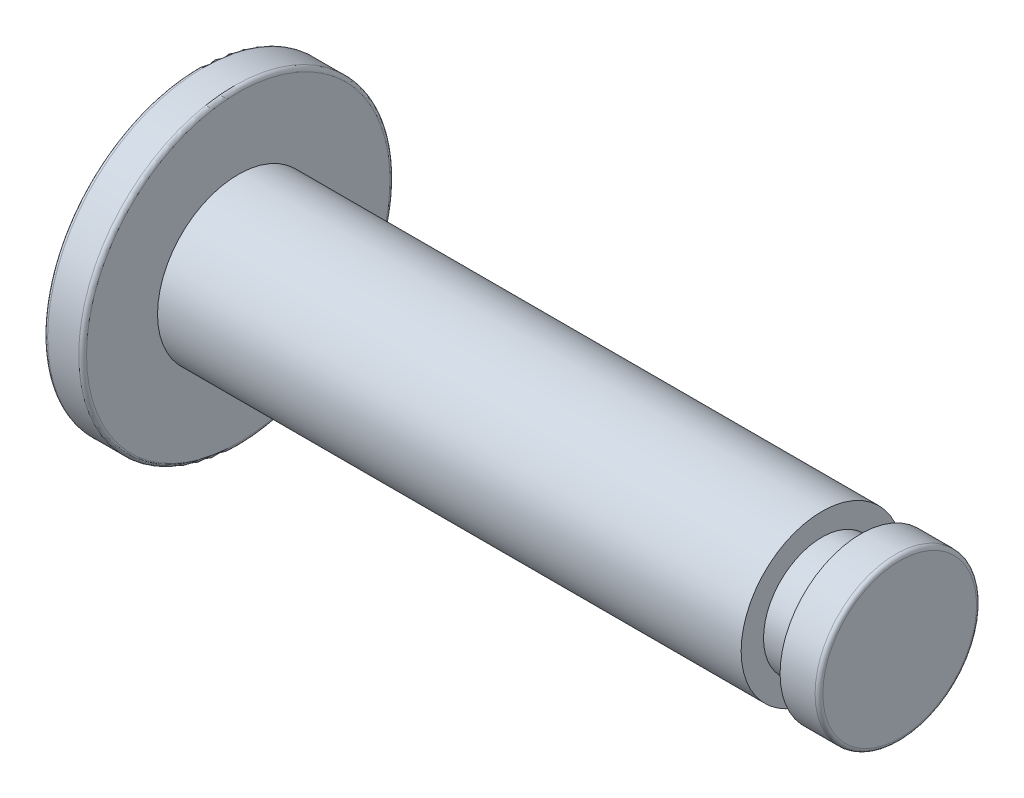
ISO-10303-21;
HEADER;
FILE_DESCRIPTION(('STEP AP214'),'2;1');
FILE_NAME('part.step','',(''),(''),'','','');
FILE_SCHEMA(('AUTOMOTIVE_DESIGN { 1 0 10303 214 1 1 1 1 }'));
ENDSEC;
DATA;
#1=APPLICATION_CONTEXT('core data for automotive mechanical design processes');
#2=APPLICATION_PROTOCOL_DEFINITION('international standard','automotive_design',2000,#1);
#3=PRODUCT_CONTEXT('',#1,'mechanical');
#4=PRODUCT('Part','Part','',(#3));
#5=PRODUCT_RELATED_PRODUCT_CATEGORY('part','',(#4));
#6=PRODUCT_DEFINITION_FORMATION('','',#4);
#7=PRODUCT_DEFINITION_CONTEXT('part definition',#1,'design');
#8=PRODUCT_DEFINITION('design','',#6,#7);
#9=PRODUCT_DEFINITION_SHAPE('','',#8);
#10=(LENGTH_UNIT() NAMED_UNIT(*) SI_UNIT(.MILLI.,.METRE.));
#11=(NAMED_UNIT(*) PLANE_ANGLE_UNIT() SI_UNIT($,.RADIAN.));
#12=(NAMED_UNIT(*) SI_UNIT($,.STERADIAN.) SOLID_ANGLE_UNIT());
#13=UNCERTAINTY_MEASURE_WITH_UNIT(LENGTH_MEASURE(1.E-05),#10,'distance_accuracy_value','');
#14=(GEOMETRIC_REPRESENTATION_CONTEXT(3) GLOBAL_UNCERTAINTY_ASSIGNED_CONTEXT((#13)) GLOBAL_UNIT_ASSIGNED_CONTEXT((#10,
#11,#12)) REPRESENTATION_CONTEXT('',''));
#15=CARTESIAN_POINT('',(0.,0.,0.));
#16=DIRECTION('',(0.,0.,1.));
#17=DIRECTION('',(1.,0.,0.));
#18=AXIS2_PLACEMENT_3D('',#15,#16,#17);
#19=CARTESIAN_POINT('',(0.,0.,0.));
#20=DIRECTION('',(1.,0.,0.));
#21=DIRECTION('',(0.,0.,-1.));
#22=AXIS2_PLACEMENT_3D('',#19,#20,#21);
#23=PLANE('',#22);
#24=CARTESIAN_POINT('',(0.,0.,0.));
#25=DIRECTION('',(1.,0.,0.));
#26=DIRECTION('',(0.,0.,-1.));
#27=AXIS2_PLACEMENT_3D('',#24,#25,#26);
#28=CIRCLE('',#27,3.9);
#29=CARTESIAN_POINT('',(0.,0.,-3.9));
#30=VERTEX_POINT('',#29);
#31=EDGE_CURVE('E43',#30,#30,#28,.F.);
#32=ORIENTED_EDGE('',*,*,#31,.T.);
#33=EDGE_LOOP('',(#32));
#34=FACE_BOUND('',#33,.T.);
#35=ADVANCED_FACE('F28',(#34),#23,.F.);
#36=CARTESIAN_POINT('',(-1.61966058348987,0.,0.));
#37=DIRECTION('',(-1.,0.,0.));
#38=DIRECTION('',(0.,0.,1.));
#39=AXIS2_PLACEMENT_3D('',#36,#37,#38);
#40=CYLINDRICAL_SURFACE('',#39,4.);
#41=CARTESIAN_POINT('',(0.1,0.,0.));
#42=DIRECTION('',(1.,0.,0.));
#43=DIRECTION('',(0.,0.,-1.));
#44=AXIS2_PLACEMENT_3D('',#41,#42,#43);
#45=CIRCLE('',#44,4.);
#46=CARTESIAN_POINT('',(0.1,0.,-4.));
#47=VERTEX_POINT('',#46);
#48=EDGE_CURVE('E35',#47,#47,#45,.T.);
#49=ORIENTED_EDGE('',*,*,#48,.T.);
#50=EDGE_LOOP('',(#49));
#51=FACE_BOUND('',#50,.T.);
#52=CARTESIAN_POINT('',(0.9,0.,0.));
#53=DIRECTION('',(-1.,0.,0.));
#54=DIRECTION('',(0.,0.,1.));
#55=AXIS2_PLACEMENT_3D('',#52,#53,#54);
#56=CIRCLE('',#55,4.);
#57=CARTESIAN_POINT('',(0.9,0.,4.));
#58=VERTEX_POINT('',#57);
#59=EDGE_CURVE('E39',#58,#58,#56,.T.);
#60=ORIENTED_EDGE('',*,*,#59,.T.);
#61=EDGE_LOOP('',(#60));
#62=FACE_BOUND('',#61,.T.);
#63=ADVANCED_FACE('F88',(#51,#62),#40,.T.);
#64=CARTESIAN_POINT('',(1.,4.,0.));
#65=DIRECTION('',(-1.,0.,0.));
#66=DIRECTION('',(0.,0.,1.));
#67=AXIS2_PLACEMENT_3D('',#64,#65,#66);
#68=PLANE('',#67);
#69=CARTESIAN_POINT('',(1.,0.,0.));
#70=DIRECTION('',(-1.,0.,0.));
#71=DIRECTION('',(0.,0.,1.));
#72=AXIS2_PLACEMENT_3D('',#69,#70,#71);
#73=CIRCLE('',#72,3.9);
#74=CARTESIAN_POINT('',(1.,0.,3.9));
#75=VERTEX_POINT('',#74);
#76=EDGE_CURVE('E10',#75,#75,#73,.F.);
#77=ORIENTED_EDGE('',*,*,#76,.T.);
#78=EDGE_LOOP('',(#77));
#79=FACE_BOUND('',#78,.T.);
#80=CARTESIAN_POINT('',(1.,0.,0.));
#81=DIRECTION('',(-1.,0.,0.));
#82=DIRECTION('',(0.,0.,1.));
#83=AXIS2_PLACEMENT_3D('',#80,#81,#82);
#84=CIRCLE('',#83,2.075);
#85=CARTESIAN_POINT('',(1.,0.,2.075));
#86=VERTEX_POINT('',#85);
#87=EDGE_CURVE('E54',#86,#86,#84,.T.);
#88=ORIENTED_EDGE('',*,*,#87,.T.);
#89=EDGE_LOOP('',(#88));
#90=FACE_BOUND('',#89,.T.);
#91=ADVANCED_FACE('F94',(#79,#90),#68,.F.);
#92=CARTESIAN_POINT('',(-1.61966058348987,0.,0.));
#93=DIRECTION('',(-1.,0.,0.));
#94=DIRECTION('',(0.,0.,1.));
#95=AXIS2_PLACEMENT_3D('',#92,#93,#94);
#96=CYLINDRICAL_SURFACE('',#95,2.075);
#97=ORIENTED_EDGE('',*,*,#87,.F.);
#98=EDGE_LOOP('',(#97));
#99=FACE_BOUND('',#98,.T.);
#100=CARTESIAN_POINT('',(16.,0.,0.));
#101=DIRECTION('',(-1.,0.,0.));
#102=DIRECTION('',(0.,0.,1.));
#103=AXIS2_PLACEMENT_3D('',#100,#101,#102);
#104=CIRCLE('',#103,2.075);
#105=CARTESIAN_POINT('',(16.,0.,2.075));
#106=VERTEX_POINT('',#105);
#107=EDGE_CURVE('E57',#106,#106,#104,.T.);
#108=ORIENTED_EDGE('',*,*,#107,.T.);
#109=EDGE_LOOP('',(#108));
#110=FACE_BOUND('',#109,.T.);
#111=ADVANCED_FACE('F144',(#99,#110),#96,.T.);
#112=CARTESIAN_POINT('',(16.,2.075,0.));
#113=DIRECTION('',(-1.,0.,0.));
#114=DIRECTION('',(0.,0.,1.));
#115=AXIS2_PLACEMENT_3D('',#112,#113,#114);
#116=PLANE('',#115);
#117=ORIENTED_EDGE('',*,*,#107,.F.);
#118=EDGE_LOOP('',(#117));
#119=FACE_BOUND('',#118,.T.);
#120=CARTESIAN_POINT('',(16.,0.,0.));
#121=DIRECTION('',(-1.,0.,0.));
#122=DIRECTION('',(0.,0.,1.));
#123=AXIS2_PLACEMENT_3D('',#120,#121,#122);
#124=CIRCLE('',#123,1.5);
#125=CARTESIAN_POINT('',(16.,0.,1.5));
#126=VERTEX_POINT('',#125);
#127=EDGE_CURVE('E60',#126,#126,#124,.T.);
#128=ORIENTED_EDGE('',*,*,#127,.T.);
#129=EDGE_LOOP('',(#128));
#130=FACE_BOUND('',#129,.T.);
#131=ADVANCED_FACE('F169',(#119,#130),#116,.F.);
#132=CARTESIAN_POINT('',(-1.61966058348987,0.,0.));
#133=DIRECTION('',(-1.,0.,0.));
#134=DIRECTION('',(0.,0.,1.));
#135=AXIS2_PLACEMENT_3D('',#132,#133,#134);
#136=CYLINDRICAL_SURFACE('',#135,1.5);
#137=ORIENTED_EDGE('',*,*,#127,.F.);
#138=EDGE_LOOP('',(#137));
#139=FACE_BOUND('',#138,.T.);
#140=CARTESIAN_POINT('',(17.,0.,0.));
#141=DIRECTION('',(-1.,0.,0.));
#142=DIRECTION('',(0.,0.,1.));
#143=AXIS2_PLACEMENT_3D('',#140,#141,#142);
#144=CIRCLE('',#143,1.5);
#145=CARTESIAN_POINT('',(17.,0.,1.5));
#146=VERTEX_POINT('',#145);
#147=EDGE_CURVE('E63',#146,#146,#144,.T.);
#148=ORIENTED_EDGE('',*,*,#147,.T.);
#149=EDGE_LOOP('',(#148));
#150=FACE_BOUND('',#149,.T.);
#151=ADVANCED_FACE('F84',(#139,#150),#136,.T.);
#152=CARTESIAN_POINT('',(17.,1.5,0.));
#153=DIRECTION('',(1.,0.,0.));
#154=DIRECTION('',(0.,0.,-1.));
#155=AXIS2_PLACEMENT_3D('',#152,#153,#154);
#156=PLANE('',#155);
#157=ORIENTED_EDGE('',*,*,#147,.F.);
#158=EDGE_LOOP('',(#157));
#159=FACE_BOUND('',#158,.T.);
#160=CARTESIAN_POINT('',(17.,0.,0.));
#161=DIRECTION('',(-1.,0.,0.));
#162=DIRECTION('',(0.,0.,1.));
#163=AXIS2_PLACEMENT_3D('',#160,#161,#162);
#164=CIRCLE('',#163,2.075);
#165=CARTESIAN_POINT('',(17.,0.,2.075));
#166=VERTEX_POINT('',#165);
#167=EDGE_CURVE('E66',#166,#166,#164,.T.);
#168=ORIENTED_EDGE('',*,*,#167,.T.);
#169=EDGE_LOOP('',(#168));
#170=FACE_BOUND('',#169,.T.);
#171=ADVANCED_FACE('F70',(#159,#170),#156,.F.);
#172=CARTESIAN_POINT('',(-1.61966058348987,0.,0.));
#173=DIRECTION('',(-1.,0.,0.));
#174=DIRECTION('',(0.,0.,1.));
#175=AXIS2_PLACEMENT_3D('',#172,#173,#174);
#176=CYLINDRICAL_SURFACE('',#175,2.075);
#177=CARTESIAN_POINT('',(17.9,0.,0.));
#178=DIRECTION('',(-1.,0.,0.));
#179=DIRECTION('',(0.,0.,1.));
#180=AXIS2_PLACEMENT_3D('',#177,#178,#179);
#181=CIRCLE('',#180,2.075);
#182=CARTESIAN_POINT('',(17.9,0.,2.075));
#183=VERTEX_POINT('',#182);
#184=EDGE_CURVE('E51',#183,#183,#181,.T.);
#185=ORIENTED_EDGE('',*,*,#184,.T.);
#186=EDGE_LOOP('',(#185));
#187=FACE_BOUND('',#186,.T.);
#188=ORIENTED_EDGE('',*,*,#167,.F.);
#189=EDGE_LOOP('',(#188));
#190=FACE_BOUND('',#189,.T.);
#191=ADVANCED_FACE('F72',(#187,#190),#176,.T.);
#192=CARTESIAN_POINT('',(18.,2.075,0.));
#193=DIRECTION('',(-1.,0.,0.));
#194=DIRECTION('',(0.,0.,1.));
#195=AXIS2_PLACEMENT_3D('',#192,#193,#194);
#196=PLANE('',#195);
#197=CARTESIAN_POINT('',(18.,0.,0.));
#198=DIRECTION('',(-1.,0.,0.));
#199=DIRECTION('',(0.,0.,1.));
#200=AXIS2_PLACEMENT_3D('',#197,#198,#199);
#201=CIRCLE('',#200,1.975);
#202=CARTESIAN_POINT('',(18.,0.,1.975));
#203=VERTEX_POINT('',#202);
#204=EDGE_CURVE('E48',#203,#203,#201,.F.);
#205=ORIENTED_EDGE('',*,*,#204,.T.);
#206=EDGE_LOOP('',(#205));
#207=FACE_BOUND('',#206,.T.);
#208=ADVANCED_FACE('F74',(#207),#196,.F.);
#209=CARTESIAN_POINT('',(17.9,0.,0.));
#210=DIRECTION('',(-1.,0.,0.));
#211=DIRECTION('',(0.,0.,1.));
#212=AXIS2_PLACEMENT_3D('',#209,#210,#211);
#213=TOROIDAL_SURFACE('',#212,1.975,0.1);
#214=ORIENTED_EDGE('',*,*,#204,.F.);
#215=EDGE_LOOP('',(#214));
#216=FACE_BOUND('',#215,.T.);
#217=ORIENTED_EDGE('',*,*,#184,.F.);
#218=EDGE_LOOP('',(#217));
#219=FACE_BOUND('',#218,.T.);
#220=ADVANCED_FACE('F81',(#216,#219),#213,.T.);
#221=CARTESIAN_POINT('',(0.1,0.,0.));
#222=DIRECTION('',(1.,0.,0.));
#223=DIRECTION('',(0.,0.,-1.));
#224=AXIS2_PLACEMENT_3D('',#221,#222,#223);
#225=TOROIDAL_SURFACE('',#224,3.9,0.1);
#226=ORIENTED_EDGE('',*,*,#48,.F.);
#227=EDGE_LOOP('',(#226));
#228=FACE_BOUND('',#227,.T.);
#229=ORIENTED_EDGE('',*,*,#31,.F.);
#230=EDGE_LOOP('',(#229));
#231=FACE_BOUND('',#230,.T.);
#232=ADVANCED_FACE('F99',(#228,#231),#225,.T.);
#233=CARTESIAN_POINT('',(0.9,0.,0.));
#234=DIRECTION('',(-1.,0.,0.));
#235=DIRECTION('',(0.,0.,1.));
#236=AXIS2_PLACEMENT_3D('',#233,#234,#235);
#237=TOROIDAL_SURFACE('',#236,3.9,0.1);
#238=ORIENTED_EDGE('',*,*,#76,.F.);
#239=EDGE_LOOP('',(#238));
#240=FACE_BOUND('',#239,.T.);
#241=ORIENTED_EDGE('',*,*,#59,.F.);
#242=EDGE_LOOP('',(#241));
#243=FACE_BOUND('',#242,.T.);
#244=ADVANCED_FACE('F30',(#240,#243),#237,.T.);
#245=CLOSED_SHELL('',(#35,#63,#91,#111,#131,#151,#171,#191,#208,#220,#232,#244));
#246=MANIFOLD_SOLID_BREP('B2',#245);
#247=ADVANCED_BREP_SHAPE_REPRESENTATION('',(#18,#246),#14);
#248=SHAPE_DEFINITION_REPRESENTATION(#9,#247);
ENDSEC;
END-ISO-10303-21;
